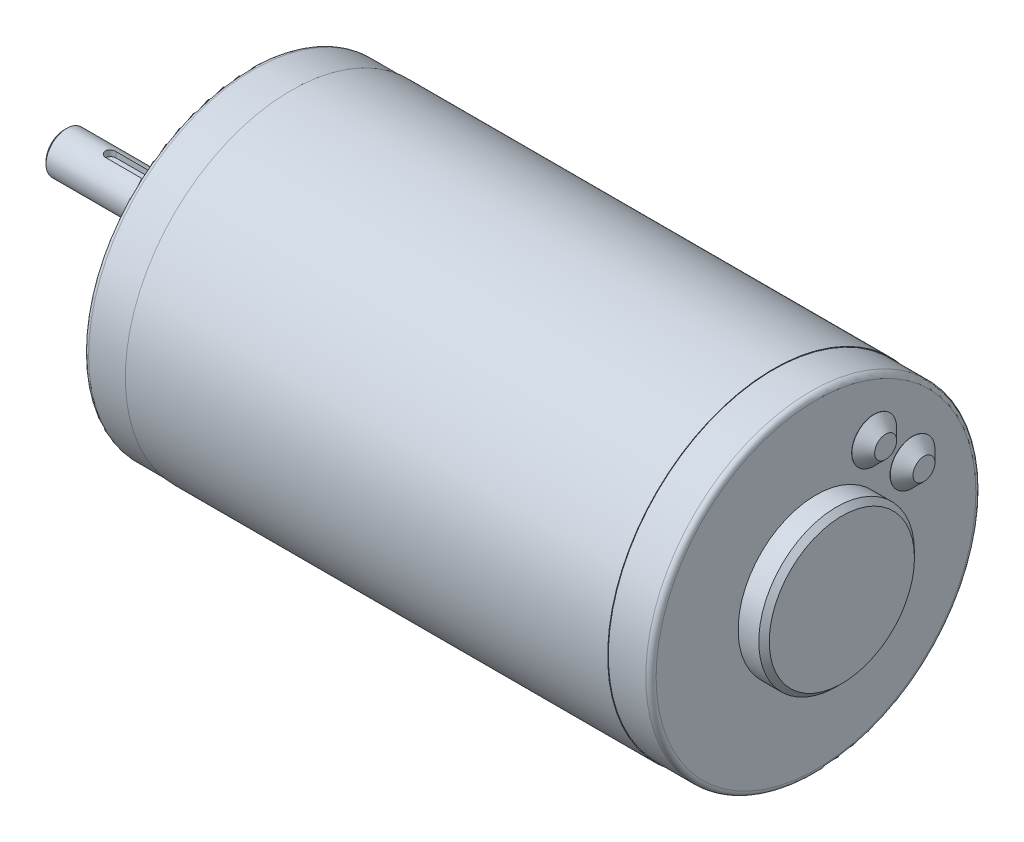
ISO-10303-21;
HEADER;
FILE_DESCRIPTION(('STEP AP214'),'2;1');
FILE_NAME('part.step','',(''),(''),'','','');
FILE_SCHEMA(('AUTOMOTIVE_DESIGN { 1 0 10303 214 1 1 1 1 }'));
ENDSEC;
DATA;
#1=APPLICATION_CONTEXT('core data for automotive mechanical design processes');
#2=APPLICATION_PROTOCOL_DEFINITION('international standard','automotive_design',2000,#1);
#3=PRODUCT_CONTEXT('',#1,'mechanical');
#4=PRODUCT('Part','Part','',(#3));
#5=PRODUCT_RELATED_PRODUCT_CATEGORY('part','',(#4));
#6=PRODUCT_DEFINITION_FORMATION('','',#4);
#7=PRODUCT_DEFINITION_CONTEXT('part definition',#1,'design');
#8=PRODUCT_DEFINITION('design','',#6,#7);
#9=PRODUCT_DEFINITION_SHAPE('','',#8);
#10=(LENGTH_UNIT() NAMED_UNIT(*) SI_UNIT(.MILLI.,.METRE.));
#11=(NAMED_UNIT(*) PLANE_ANGLE_UNIT() SI_UNIT($,.RADIAN.));
#12=(NAMED_UNIT(*) SI_UNIT($,.STERADIAN.) SOLID_ANGLE_UNIT());
#13=UNCERTAINTY_MEASURE_WITH_UNIT(LENGTH_MEASURE(1.E-05),#10,'distance_accuracy_value','');
#14=(GEOMETRIC_REPRESENTATION_CONTEXT(3) GLOBAL_UNCERTAINTY_ASSIGNED_CONTEXT((#13)) GLOBAL_UNIT_ASSIGNED_CONTEXT((#10,
#11,#12)) REPRESENTATION_CONTEXT('',''));
#15=CARTESIAN_POINT('',(0.,0.,0.));
#16=DIRECTION('',(0.,0.,1.));
#17=DIRECTION('',(1.,0.,0.));
#18=AXIS2_PLACEMENT_3D('',#15,#16,#17);
#19=CARTESIAN_POINT('',(8.2296,0.,0.));
#20=DIRECTION('',(1.,0.,0.));
#21=DIRECTION('',(0.,0.,-1.));
#22=AXIS2_PLACEMENT_3D('',#19,#20,#21);
#23=CYLINDRICAL_SURFACE('',#22,32.004);
#24=CARTESIAN_POINT('',(8.2296,0.,0.));
#25=DIRECTION('',(1.,0.,0.));
#26=DIRECTION('',(0.,0.,-1.));
#27=AXIS2_PLACEMENT_3D('',#24,#25,#26);
#28=CIRCLE('',#27,32.004);
#29=CARTESIAN_POINT('',(8.2296,0.,-32.004));
#30=VERTEX_POINT('',#29);
#31=EDGE_CURVE('P0_E184',#30,#30,#28,.T.);
#32=ORIENTED_EDGE('',*,*,#31,.T.);
#33=EDGE_LOOP('',(#32));
#34=FACE_BOUND('',#33,.T.);
#35=CARTESIAN_POINT('',(101.3704,0.,0.));
#36=DIRECTION('',(1.,0.,0.));
#37=DIRECTION('',(0.,0.,-1.));
#38=AXIS2_PLACEMENT_3D('',#35,#36,#37);
#39=CIRCLE('',#38,32.004);
#40=CARTESIAN_POINT('',(101.3704,0.,-32.004));
#41=VERTEX_POINT('',#40);
#42=EDGE_CURVE('P0_E178',#41,#41,#39,.T.);
#43=ORIENTED_EDGE('',*,*,#42,.F.);
#44=EDGE_LOOP('',(#43));
#45=FACE_BOUND('',#44,.T.);
#46=ADVANCED_FACE('P0_F37',(#34,#45),#23,.T.);
#47=CARTESIAN_POINT('',(8.2296,32.004,0.));
#48=DIRECTION('',(-1.,0.,0.));
#49=DIRECTION('',(0.,0.,1.));
#50=AXIS2_PLACEMENT_3D('',#47,#48,#49);
#51=PLANE('',#50);
#52=CARTESIAN_POINT('',(8.2296,0.,0.));
#53=DIRECTION('',(-1.,0.,0.));
#54=DIRECTION('',(0.,0.,1.));
#55=AXIS2_PLACEMENT_3D('',#52,#53,#54);
#56=CIRCLE('',#55,31.877);
#57=CARTESIAN_POINT('',(8.2296,0.,31.877));
#58=VERTEX_POINT('',#57);
#59=EDGE_CURVE('P0_E169',#58,#58,#56,.T.);
#60=ORIENTED_EDGE('',*,*,#59,.F.);
#61=EDGE_LOOP('',(#60));
#62=FACE_BOUND('',#61,.T.);
#63=ORIENTED_EDGE('',*,*,#31,.F.);
#64=EDGE_LOOP('',(#63));
#65=FACE_BOUND('',#64,.T.);
#66=ADVANCED_FACE('P0_F227',(#62,#65),#51,.T.);
#67=CARTESIAN_POINT('',(101.3704,0.,0.));
#68=DIRECTION('',(1.,0.,0.));
#69=DIRECTION('',(0.,0.,-1.));
#70=AXIS2_PLACEMENT_3D('',#67,#68,#69);
#71=PLANE('',#70);
#72=CARTESIAN_POINT('',(101.3704,0.,0.));
#73=DIRECTION('',(1.,0.,0.));
#74=DIRECTION('',(0.,0.,-1.));
#75=AXIS2_PLACEMENT_3D('',#72,#73,#74);
#76=CIRCLE('',#75,31.877);
#77=CARTESIAN_POINT('',(101.3704,0.,-31.877));
#78=VERTEX_POINT('',#77);
#79=EDGE_CURVE('P0_E181',#78,#78,#76,.T.);
#80=ORIENTED_EDGE('',*,*,#79,.F.);
#81=EDGE_LOOP('',(#80));
#82=FACE_BOUND('',#81,.T.);
#83=ORIENTED_EDGE('',*,*,#42,.T.);
#84=EDGE_LOOP('',(#83));
#85=FACE_BOUND('',#84,.T.);
#86=ADVANCED_FACE('P0_F233',(#82,#85),#71,.T.);
#87=CARTESIAN_POINT('',(109.6,0.,0.));
#88=DIRECTION('',(-1.,0.,0.));
#89=DIRECTION('',(0.,0.,1.));
#90=AXIS2_PLACEMENT_3D('',#87,#88,#89);
#91=CYLINDRICAL_SURFACE('',#90,31.877);
#92=CARTESIAN_POINT('',(108.6,0.,0.));
#93=DIRECTION('',(1.,0.,0.));
#94=DIRECTION('',(0.,0.,-1.));
#95=AXIS2_PLACEMENT_3D('',#92,#93,#94);
#96=CIRCLE('',#95,31.877);
#97=CARTESIAN_POINT('',(108.6,0.,-31.877));
#98=VERTEX_POINT('',#97);
#99=EDGE_CURVE('P0_E209',#98,#98,#96,.F.);
#100=ORIENTED_EDGE('',*,*,#99,.T.);
#101=EDGE_LOOP('',(#100));
#102=FACE_BOUND('',#101,.T.);
#103=ORIENTED_EDGE('',*,*,#79,.T.);
#104=EDGE_LOOP('',(#103));
#105=FACE_BOUND('',#104,.T.);
#106=ADVANCED_FACE('P0_F295',(#102,#105),#91,.T.);
#107=CARTESIAN_POINT('',(109.6,0.,0.));
#108=DIRECTION('',(1.,0.,0.));
#109=DIRECTION('',(0.,0.,-1.));
#110=AXIS2_PLACEMENT_3D('',#107,#108,#109);
#111=PLANE('',#110);
#112=CARTESIAN_POINT('',(109.6,0.,0.));
#113=DIRECTION('',(1.,0.,0.));
#114=DIRECTION('',(0.,0.,-1.));
#115=AXIS2_PLACEMENT_3D('',#112,#113,#114);
#116=CIRCLE('',#115,30.877);
#117=CARTESIAN_POINT('',(109.6,0.,-30.877));
#118=VERTEX_POINT('',#117);
#119=EDGE_CURVE('P0_E206',#118,#118,#116,.T.);
#120=ORIENTED_EDGE('',*,*,#119,.T.);
#121=EDGE_LOOP('',(#120));
#122=FACE_BOUND('',#121,.T.);
#123=CARTESIAN_POINT('',(109.6,18.6070906828553,-11.2073596390943));
#124=DIRECTION('',(1.,0.,0.));
#125=DIRECTION('',(0.,0.,-1.));
#126=AXIS2_PLACEMENT_3D('',#123,#124,#125);
#127=CIRCLE('',#126,4.318);
#128=CARTESIAN_POINT('',(109.6,18.6070906828553,-15.5253596390943));
#129=VERTEX_POINT('',#128);
#130=EDGE_CURVE('P0_E191',#129,#129,#127,.T.);
#131=ORIENTED_EDGE('',*,*,#130,.F.);
#132=EDGE_LOOP('',(#131));
#133=FACE_BOUND('',#132,.T.);
#134=CARTESIAN_POINT('',(109.6,11.2073596390943,-18.6070906828553));
#135=DIRECTION('',(1.,0.,0.));
#136=DIRECTION('',(0.,0.,-1.));
#137=AXIS2_PLACEMENT_3D('',#134,#135,#136);
#138=CIRCLE('',#137,4.318);
#139=CARTESIAN_POINT('',(109.6,11.2073596390943,-22.9250906828553));
#140=VERTEX_POINT('',#139);
#141=EDGE_CURVE('P0_E165',#140,#140,#138,.T.);
#142=ORIENTED_EDGE('',*,*,#141,.F.);
#143=EDGE_LOOP('',(#142));
#144=FACE_BOUND('',#143,.T.);
#145=CARTESIAN_POINT('',(109.6,0.,0.));
#146=DIRECTION('',(1.,0.,0.));
#147=DIRECTION('',(0.,0.,-1.));
#148=AXIS2_PLACEMENT_3D('',#145,#146,#147);
#149=CIRCLE('',#148,15.0368);
#150=CARTESIAN_POINT('',(109.6,0.,-15.0368));
#151=VERTEX_POINT('',#150);
#152=EDGE_CURVE('P0_E172',#151,#151,#149,.T.);
#153=ORIENTED_EDGE('',*,*,#152,.F.);
#154=EDGE_LOOP('',(#153));
#155=FACE_BOUND('',#154,.T.);
#156=ADVANCED_FACE('P0_F291',(#122,#133,#144,#155),#111,.T.);
#157=CARTESIAN_POINT('',(113.584,0.,0.));
#158=DIRECTION('',(-1.,0.,0.));
#159=DIRECTION('',(0.,0.,1.));
#160=AXIS2_PLACEMENT_3D('',#157,#158,#159);
#161=CYLINDRICAL_SURFACE('',#160,15.0368);
#162=CARTESIAN_POINT('',(113.584,0.,0.));
#163=DIRECTION('',(1.,0.,0.));
#164=DIRECTION('',(0.,0.,-1.));
#165=AXIS2_PLACEMENT_3D('',#162,#163,#164);
#166=CIRCLE('',#165,15.0368);
#167=CARTESIAN_POINT('',(113.584,0.,-15.0368));
#168=VERTEX_POINT('',#167);
#169=EDGE_CURVE('P0_E175',#168,#168,#166,.T.);
#170=ORIENTED_EDGE('',*,*,#169,.F.);
#171=EDGE_LOOP('',(#170));
#172=FACE_BOUND('',#171,.T.);
#173=ORIENTED_EDGE('',*,*,#152,.T.);
#174=EDGE_LOOP('',(#173));
#175=FACE_BOUND('',#174,.T.);
#176=ADVANCED_FACE('P0_F287',(#172,#175),#161,.T.);
#177=CARTESIAN_POINT('',(113.584,0.,0.));
#178=DIRECTION('',(-1.,0.,0.));
#179=DIRECTION('',(0.,0.,-1.));
#180=AXIS2_PLACEMENT_3D('',#177,#178,#179);
#181=CONICAL_SURFACE('',#180,15.0368,0.785398163397437);
#182=CARTESIAN_POINT('',(114.6,0.,0.));
#183=DIRECTION('',(1.,0.,0.));
#184=DIRECTION('',(0.,0.,-1.));
#185=AXIS2_PLACEMENT_3D('',#182,#183,#184);
#186=CIRCLE('',#185,14.0208);
#187=CARTESIAN_POINT('',(114.6,0.,-14.0208));
#188=VERTEX_POINT('',#187);
#189=EDGE_CURVE('P0_E120',#188,#188,#186,.T.);
#190=ORIENTED_EDGE('',*,*,#189,.F.);
#191=EDGE_LOOP('',(#190));
#192=FACE_BOUND('',#191,.T.);
#193=ORIENTED_EDGE('',*,*,#169,.T.);
#194=EDGE_LOOP('',(#193));
#195=FACE_BOUND('',#194,.T.);
#196=ADVANCED_FACE('P0_F283',(#192,#195),#181,.T.);
#197=CARTESIAN_POINT('',(114.6,0.,0.));
#198=DIRECTION('',(1.,0.,0.));
#199=DIRECTION('',(0.,0.,-1.));
#200=AXIS2_PLACEMENT_3D('',#197,#198,#199);
#201=PLANE('',#200);
#202=ORIENTED_EDGE('',*,*,#189,.T.);
#203=EDGE_LOOP('',(#202));
#204=FACE_BOUND('',#203,.T.);
#205=ADVANCED_FACE('P0_F279',(#204),#201,.T.);
#206=CARTESIAN_POINT('',(0.,0.,0.));
#207=DIRECTION('',(1.,0.,0.));
#208=DIRECTION('',(0.,0.,-1.));
#209=AXIS2_PLACEMENT_3D('',#206,#207,#208);
#210=CYLINDRICAL_SURFACE('',#209,31.877);
#211=CARTESIAN_POINT('',(0.999999999999998,0.,0.));
#212=DIRECTION('',(-1.,0.,0.));
#213=DIRECTION('',(0.,0.,1.));
#214=AXIS2_PLACEMENT_3D('',#211,#212,#213);
#215=CIRCLE('',#214,31.877);
#216=CARTESIAN_POINT('',(0.999999999999998,0.,31.877));
#217=VERTEX_POINT('',#216);
#218=EDGE_CURVE('P0_E11',#217,#217,#215,.F.);
#219=ORIENTED_EDGE('',*,*,#218,.T.);
#220=EDGE_LOOP('',(#219));
#221=FACE_BOUND('',#220,.T.);
#222=ORIENTED_EDGE('',*,*,#59,.T.);
#223=EDGE_LOOP('',(#222));
#224=FACE_BOUND('',#223,.T.);
#225=ADVANCED_FACE('P0_F276',(#221,#224),#210,.T.);
#226=CARTESIAN_POINT('',(0.,0.,0.));
#227=DIRECTION('',(-1.,0.,0.));
#228=DIRECTION('',(0.,0.,1.));
#229=AXIS2_PLACEMENT_3D('',#226,#227,#228);
#230=PLANE('',#229);
#231=CARTESIAN_POINT('',(0.,0.,0.));
#232=DIRECTION('',(-1.,0.,0.));
#233=DIRECTION('',(0.,0.,1.));
#234=AXIS2_PLACEMENT_3D('',#231,#232,#233);
#235=CIRCLE('',#234,30.877);
#236=CARTESIAN_POINT('',(0.,0.,30.877));
#237=VERTEX_POINT('',#236);
#238=EDGE_CURVE('P0_E45',#237,#237,#235,.T.);
#239=ORIENTED_EDGE('',*,*,#238,.T.);
#240=EDGE_LOOP('',(#239));
#241=FACE_BOUND('',#240,.T.);
#242=CARTESIAN_POINT('',(0.,25.4,0.));
#243=DIRECTION('',(-1.,0.,0.));
#244=DIRECTION('',(0.,0.,1.));
#245=AXIS2_PLACEMENT_3D('',#242,#243,#244);
#246=CIRCLE('',#245,2.01929999999999);
#247=CARTESIAN_POINT('',(0.,25.4,2.01929999999999));
#248=VERTEX_POINT('',#247);
#249=EDGE_CURVE('P0_E94',#248,#248,#246,.T.);
#250=ORIENTED_EDGE('',*,*,#249,.F.);
#251=EDGE_LOOP('',(#250));
#252=FACE_BOUND('',#251,.T.);
#253=CARTESIAN_POINT('',(0.,-25.4,0.));
#254=DIRECTION('',(-1.,0.,0.));
#255=DIRECTION('',(0.,0.,1.));
#256=AXIS2_PLACEMENT_3D('',#253,#254,#255);
#257=CIRCLE('',#256,2.01929999999999);
#258=CARTESIAN_POINT('',(0.,-25.4,2.01929999999999));
#259=VERTEX_POINT('',#258);
#260=EDGE_CURVE('P0_E93',#259,#259,#257,.T.);
#261=ORIENTED_EDGE('',*,*,#260,.F.);
#262=EDGE_LOOP('',(#261));
#263=FACE_BOUND('',#262,.T.);
#264=CARTESIAN_POINT('',(0.,0.,0.));
#265=DIRECTION('',(-1.,0.,0.));
#266=DIRECTION('',(0.,0.,1.));
#267=AXIS2_PLACEMENT_3D('',#264,#265,#266);
#268=CIRCLE('',#267,9.525);
#269=CARTESIAN_POINT('',(0.,0.,9.525));
#270=VERTEX_POINT('',#269);
#271=EDGE_CURVE('P0_E166',#270,#270,#268,.T.);
#272=ORIENTED_EDGE('',*,*,#271,.F.);
#273=EDGE_LOOP('',(#272));
#274=FACE_BOUND('',#273,.T.);
#275=ADVANCED_FACE('P0_F214',(#241,#252,#263,#274),#230,.T.);
#276=CARTESIAN_POINT('',(-4.,0.,0.));
#277=DIRECTION('',(1.,0.,0.));
#278=DIRECTION('',(0.,0.,-1.));
#279=AXIS2_PLACEMENT_3D('',#276,#277,#278);
#280=CYLINDRICAL_SURFACE('',#279,9.525);
#281=CARTESIAN_POINT('',(-2.98400000000005,0.,0.));
#282=DIRECTION('',(-1.,0.,0.));
#283=DIRECTION('',(0.,0.,1.));
#284=AXIS2_PLACEMENT_3D('',#281,#282,#283);
#285=CIRCLE('',#284,9.525);
#286=CARTESIAN_POINT('',(-2.98400000000005,0.,9.525));
#287=VERTEX_POINT('',#286);
#288=EDGE_CURVE('P0_E197',#287,#287,#285,.F.);
#289=ORIENTED_EDGE('',*,*,#288,.T.);
#290=EDGE_LOOP('',(#289));
#291=FACE_BOUND('',#290,.T.);
#292=ORIENTED_EDGE('',*,*,#271,.T.);
#293=EDGE_LOOP('',(#292));
#294=FACE_BOUND('',#293,.T.);
#295=ADVANCED_FACE('P0_F269',(#291,#294),#280,.T.);
#296=CARTESIAN_POINT('',(-4.,0.,0.));
#297=DIRECTION('',(-1.,0.,0.));
#298=DIRECTION('',(0.,0.,1.));
#299=AXIS2_PLACEMENT_3D('',#296,#297,#298);
#300=PLANE('',#299);
#301=CARTESIAN_POINT('',(-4.,0.,0.));
#302=DIRECTION('',(-1.,0.,0.));
#303=DIRECTION('',(0.,0.,1.));
#304=AXIS2_PLACEMENT_3D('',#301,#302,#303);
#305=CIRCLE('',#304,8.50900000000004);
#306=CARTESIAN_POINT('',(-4.,0.,8.50900000000004));
#307=VERTEX_POINT('',#306);
#308=EDGE_CURVE('P0_E194',#307,#307,#305,.T.);
#309=ORIENTED_EDGE('',*,*,#308,.T.);
#310=EDGE_LOOP('',(#309));
#311=FACE_BOUND('',#310,.T.);
#312=CARTESIAN_POINT('',(-4.,0.,0.));
#313=DIRECTION('',(-1.,0.,0.));
#314=DIRECTION('',(0.,0.,1.));
#315=AXIS2_PLACEMENT_3D('',#312,#313,#314);
#316=CIRCLE('',#315,4.);
#317=CARTESIAN_POINT('',(-4.,0.,4.));
#318=VERTEX_POINT('',#317);
#319=EDGE_CURVE('P0_E162',#318,#318,#316,.T.);
#320=ORIENTED_EDGE('',*,*,#319,.F.);
#321=EDGE_LOOP('',(#320));
#322=FACE_BOUND('',#321,.T.);
#323=ADVANCED_FACE('P0_F262',(#311,#322),#300,.T.);
#324=CARTESIAN_POINT('',(-35.6,0.,0.));
#325=DIRECTION('',(1.,0.,0.));
#326=DIRECTION('',(0.,0.,-1.));
#327=AXIS2_PLACEMENT_3D('',#324,#325,#326);
#328=CYLINDRICAL_SURFACE('',#327,4.);
#329=CARTESIAN_POINT('',(-35.099999999993,0.,0.));
#330=DIRECTION('',(-1.,0.,0.));
#331=DIRECTION('',(0.,0.,1.));
#332=AXIS2_PLACEMENT_3D('',#329,#330,#331);
#333=CIRCLE('',#332,4.);
#334=CARTESIAN_POINT('',(-35.099999999993,0.,4.));
#335=VERTEX_POINT('',#334);
#336=EDGE_CURVE('P0_E203',#335,#335,#333,.F.);
#337=ORIENTED_EDGE('',*,*,#336,.T.);
#338=EDGE_LOOP('',(#337));
#339=FACE_BOUND('',#338,.T.);
#340=DIRECTION('',(1.,0.,0.));
#341=VECTOR('',#340,1.);
#342=CARTESIAN_POINT('',(0.,3.87298334620741,-1.));
#343=LINE('',#342,#341);
#344=CARTESIAN_POINT('',(-26.6,3.87298334620741,-1.));
#345=VERTEX_POINT('',#344);
#346=CARTESIAN_POINT('',(-7.1,3.87298334620741,-1.));
#347=VERTEX_POINT('',#346);
#348=EDGE_CURVE('P0_E139',#345,#347,#343,.T.);
#349=ORIENTED_EDGE('',*,*,#348,.T.);
#350=CARTESIAN_POINT('',(-7.1,3.87298334620741,-1.));
#351=CARTESIAN_POINT('',(-7.07233701489346,3.87298148580177,-1.00000033749611));
#352=CARTESIAN_POINT('',(-7.04468773698177,3.8732800994947,-0.998851407375366));
#353=CARTESIAN_POINT('',(-6.98959596469644,3.87445904774558,-0.994271295395754));
#354=CARTESIAN_POINT('',(-6.96215343631291,3.87533928441687,-0.990840497572679));
#355=CARTESIAN_POINT('',(-6.88054682679116,3.87881710972053,-0.977175239382526));
#356=CARTESIAN_POINT('',(-6.82694353151779,3.88225203148808,-0.963567695172493));
#357=CARTESIAN_POINT('',(-6.72287532621804,3.89095422588002,-0.927798076247997));
#358=CARTESIAN_POINT('',(-6.67241012178714,3.89622132630929,-0.905636805423836));
#359=CARTESIAN_POINT('',(-6.57588855135267,3.90799134471939,-0.853415378025865));
#360=CARTESIAN_POINT('',(-6.52983337210904,3.91449459395647,-0.823353103356933));
#361=CARTESIAN_POINT('',(-6.4424561180939,3.92816262398025,-0.755484471828069));
#362=CARTESIAN_POINT('',(-6.40124511375448,3.93533791028915,-0.717537268783976));
#363=CARTESIAN_POINT('',(-6.32569791051729,3.94945104396193,-0.63527578051623));
#364=CARTESIAN_POINT('',(-6.29136281053206,3.95638885322537,-0.590960479478831));
#365=CARTESIAN_POINT('',(-6.23008899838136,3.96936182283248,-0.496456899401691));
#366=CARTESIAN_POINT('',(-6.20326010401603,3.9753830468173,-0.446195340334474));
#367=CARTESIAN_POINT('',(-6.1584752658033,3.98572346250588,-0.341702590842919));
#368=CARTESIAN_POINT('',(-6.14051757570017,3.990042989147,-0.28747218408301));
#369=CARTESIAN_POINT('',(-6.11434100722257,3.99641900005128,-0.17774410852516));
#370=CARTESIAN_POINT('',(-6.10593232757718,3.998519529013,-0.122294322002858));
#371=CARTESIAN_POINT('',(-6.09849662845671,4.00037438150815,-0.0107327756816796));
#372=CARTESIAN_POINT('',(-6.09946842980766,4.00012899993444,0.0453789000287057));
#373=CARTESIAN_POINT('',(-6.11062996368545,3.99735237365735,0.155352492972096));
#374=CARTESIAN_POINT('',(-6.12061461659948,3.9948719867736,0.209236701739855));
#375=CARTESIAN_POINT('',(-6.14918867918275,3.98796330636495,0.31453871108434));
#376=CARTESIAN_POINT('',(-6.16777846956858,3.98353492665556,0.365956402423988));
#377=CARTESIAN_POINT('',(-6.21320128067065,3.97314997761798,0.465407286024539));
#378=CARTESIAN_POINT('',(-6.24010739423284,3.96717993827555,0.513405629602248));
#379=CARTESIAN_POINT('',(-6.30134312983347,3.95435945541919,0.604276631230014));
#380=CARTESIAN_POINT('',(-6.33567387025322,3.94750887933198,0.647148515562289));
#381=CARTESIAN_POINT('',(-6.41187891208131,3.93345566022865,0.72776938970849));
#382=CARTESIAN_POINT('',(-6.45393163653981,3.92624850477685,0.765349103054127));
#383=CARTESIAN_POINT('',(-6.54382986692773,3.91246168284006,0.832969575186237));
#384=CARTESIAN_POINT('',(-6.59167695328356,3.90588218842993,0.863008270245062));
#385=CARTESIAN_POINT('',(-6.69214559782377,3.89407813586325,0.914804709285962));
#386=CARTESIAN_POINT('',(-6.74479146489609,3.88886106009136,0.936517017887269));
#387=CARTESIAN_POINT('',(-6.85311692841829,3.88047058807055,0.970702351849829));
#388=CARTESIAN_POINT('',(-6.90879185514984,3.87729413761435,0.983189189212132));
#389=CARTESIAN_POINT('',(-6.9874573807589,3.87455290681524,0.993904635150938));
#390=CARTESIAN_POINT('',(-7.00991970321318,3.87396523110859,0.996190790966708));
#391=CARTESIAN_POINT('',(-7.05491778990932,3.87318062488974,0.999236757697394));
#392=CARTESIAN_POINT('',(-7.07745337595529,3.87298306219461,0.999999038096045));
#393=CARTESIAN_POINT('',(-7.1,3.87298334620741,1.));
#394=B_SPLINE_CURVE_WITH_KNOTS('',3,(#350,#351,#352,#353,#354,#355,#356,#357,#358,#359,#360,
#361,#362,#363,#364,#365,#366,#367,#368,#369,#370,#371,#372,#373,#374,#375,#376,#377,#378,#379,
#380,#381,#382,#383,#384,#385,#386,#387,#388,#389,#390,#391,#392,#393),.UNSPECIFIED.,.F.,.F.,(4,
2,2,2,2,2,2,2,2,2,2,2,2,2,2,2,2,2,2,2,2,4),(0.,0.0829365303397693,0.165859106084651,
0.331229963080317,0.496585282091498,0.661984974726749,0.830641897427974,0.999325753539193,
1.17036187098235,1.34136430732424,1.50890481515325,1.67642426256639,1.84022545479276,
2.00403389475838,2.16932509450376,2.33464120964329,2.50441429534542,2.67423379180967,
2.84496720161068,3.01544447539986,3.08315848722648,3.15076267731671),.UNSPECIFIED.);
#395=CARTESIAN_POINT('',(-7.1,3.87298334620741,1.));
#396=VERTEX_POINT('',#395);
#397=EDGE_CURVE('P0_E116',#347,#396,#394,.T.);
#398=ORIENTED_EDGE('',*,*,#397,.T.);
#399=DIRECTION('',(1.,0.,0.));
#400=VECTOR('',#399,1.);
#401=CARTESIAN_POINT('',(0.,3.87298334620741,1.));
#402=LINE('',#401,#400);
#403=CARTESIAN_POINT('',(-26.6,3.87298334620741,1.));
#404=VERTEX_POINT('',#403);
#405=EDGE_CURVE('P0_E154',#396,#404,#402,.F.);
#406=ORIENTED_EDGE('',*,*,#405,.T.);
#407=CARTESIAN_POINT('',(-26.6,3.87298334620741,1.));
#408=CARTESIAN_POINT('',(-26.6276629851065,3.87298148580177,1.00000033749611));
#409=CARTESIAN_POINT('',(-26.6553122630182,3.8732800994947,0.998851407375366));
#410=CARTESIAN_POINT('',(-26.7104040353036,3.87445904774558,0.994271295395754));
#411=CARTESIAN_POINT('',(-26.7378465636871,3.87533928441687,0.990840497572679));
#412=CARTESIAN_POINT('',(-26.8194531732088,3.87881710972053,0.977175239382526));
#413=CARTESIAN_POINT('',(-26.8730564684822,3.88225203148808,0.963567695172493));
#414=CARTESIAN_POINT('',(-26.977124673782,3.89095422588002,0.927798076247996));
#415=CARTESIAN_POINT('',(-27.0275898782129,3.89622132630929,0.905636805423835));
#416=CARTESIAN_POINT('',(-27.1241114486473,3.90799134471939,0.853415378025864));
#417=CARTESIAN_POINT('',(-27.170166627891,3.91449459395647,0.823353103356932));
#418=CARTESIAN_POINT('',(-27.2575438819061,3.92816262398025,0.755484471828069));
#419=CARTESIAN_POINT('',(-27.2987548862455,3.93533791028915,0.717537268783975));
#420=CARTESIAN_POINT('',(-27.3743020894827,3.94945104396193,0.635275780516229));
#421=CARTESIAN_POINT('',(-27.4086371894679,3.95638885322537,0.59096047947883));
#422=CARTESIAN_POINT('',(-27.4699110016186,3.96936182283248,0.496456899401689));
#423=CARTESIAN_POINT('',(-27.496739895984,3.9753830468173,0.446195340334472));
#424=CARTESIAN_POINT('',(-27.5415247341967,3.98572346250588,0.341702590842916));
#425=CARTESIAN_POINT('',(-27.5594824242998,3.990042989147,0.287472184083007));
#426=CARTESIAN_POINT('',(-27.5856589927774,3.99641900005128,0.177744108525158));
#427=CARTESIAN_POINT('',(-27.5940676724228,3.998519529013,0.122294322002856));
#428=CARTESIAN_POINT('',(-27.6015033715433,4.00037438150815,0.0107327756816781));
#429=CARTESIAN_POINT('',(-27.6005315701923,4.00012899993444,-0.0453789000287067));
#430=CARTESIAN_POINT('',(-27.5893700363146,3.99735237365735,-0.155352492972096));
#431=CARTESIAN_POINT('',(-27.5793853834005,3.9948719867736,-0.209236701739855));
#432=CARTESIAN_POINT('',(-27.5508113208173,3.98796330636495,-0.31453871108434));
#433=CARTESIAN_POINT('',(-27.5322215304314,3.98353492665556,-0.365956402423988));
#434=CARTESIAN_POINT('',(-27.4867987193294,3.97314997761798,-0.46540728602454));
#435=CARTESIAN_POINT('',(-27.4598926057672,3.96717993827555,-0.513405629602248));
#436=CARTESIAN_POINT('',(-27.3986568701665,3.95435945541919,-0.604276631230015));
#437=CARTESIAN_POINT('',(-27.3643261297468,3.94750887933198,-0.64714851556229));
#438=CARTESIAN_POINT('',(-27.2881210879187,3.93345566022865,-0.727769389708492));
#439=CARTESIAN_POINT('',(-27.2460683634602,3.92624850477685,-0.765349103054128));
#440=CARTESIAN_POINT('',(-27.1561701330723,3.91246168284006,-0.832969575186237));
#441=CARTESIAN_POINT('',(-27.1083230467164,3.90588218842993,-0.863008270245062));
#442=CARTESIAN_POINT('',(-27.0078544021762,3.89407813586325,-0.914804709285961));
#443=CARTESIAN_POINT('',(-26.9552085351039,3.88886106009136,-0.936517017887269));
#444=CARTESIAN_POINT('',(-26.8468830715817,3.88047058807054,-0.970702351849828));
#445=CARTESIAN_POINT('',(-26.7912081448502,3.87729413761435,-0.983189189212131));
#446=CARTESIAN_POINT('',(-26.7125426192411,3.87455290681524,-0.993904635150938));
#447=CARTESIAN_POINT('',(-26.6900802967868,3.87396523110859,-0.996190790966708));
#448=CARTESIAN_POINT('',(-26.6450822100907,3.87318062488974,-0.999236757697394));
#449=CARTESIAN_POINT('',(-26.6225466240447,3.87298306219461,-0.999999038096045));
#450=CARTESIAN_POINT('',(-26.6,3.87298334620741,-1.));
#451=B_SPLINE_CURVE_WITH_KNOTS('',3,(#407,#408,#409,#410,#411,#412,#413,#414,#415,#416,#417,
#418,#419,#420,#421,#422,#423,#424,#425,#426,#427,#428,#429,#430,#431,#432,#433,#434,#435,#436,
#437,#438,#439,#440,#441,#442,#443,#444,#445,#446,#447,#448,#449,#450),.UNSPECIFIED.,.F.,.F.,(4,
2,2,2,2,2,2,2,2,2,2,2,2,2,2,2,2,2,2,2,2,4),(0.,0.0829365303397727,0.165859106084653,
0.331229963080318,0.496585282091499,0.661984974726751,0.830641897427976,0.999325753539196,
1.17036187098235,1.34136430732425,1.50890481515325,1.67642426256639,1.84022545479276,
2.00403389475838,2.16932509450376,2.33464120964329,2.50441429534542,2.67423379180967,
2.84496720161068,3.01544447539986,3.08315848722649,3.15076267731671),.UNSPECIFIED.);
#452=EDGE_CURVE('P0_E52',#404,#345,#451,.T.);
#453=ORIENTED_EDGE('',*,*,#452,.T.);
#454=EDGE_LOOP('',(#349,#398,#406,#453));
#455=FACE_BOUND('',#454,.T.);
#456=ORIENTED_EDGE('',*,*,#319,.T.);
#457=EDGE_LOOP('',(#456));
#458=FACE_BOUND('',#457,.T.);
#459=ADVANCED_FACE('P0_F254',(#339,#455,#458),#328,.T.);
#460=CARTESIAN_POINT('',(-35.6,0.,0.));
#461=DIRECTION('',(-1.,0.,0.));
#462=DIRECTION('',(0.,0.,1.));
#463=AXIS2_PLACEMENT_3D('',#460,#461,#462);
#464=PLANE('',#463);
#465=CARTESIAN_POINT('',(-35.6,0.,0.));
#466=DIRECTION('',(-1.,0.,0.));
#467=DIRECTION('',(0.,0.,1.));
#468=AXIS2_PLACEMENT_3D('',#465,#466,#467);
#469=CIRCLE('',#468,3.49999999993619);
#470=CARTESIAN_POINT('',(-35.6,0.,3.49999999993619));
#471=VERTEX_POINT('',#470);
#472=EDGE_CURVE('P0_E200',#471,#471,#469,.T.);
#473=ORIENTED_EDGE('',*,*,#472,.T.);
#474=EDGE_LOOP('',(#473));
#475=FACE_BOUND('',#474,.T.);
#476=ADVANCED_FACE('P0_F251',(#475),#464,.T.);
#477=CARTESIAN_POINT('',(-7.1,32.005,0.));
#478=DIRECTION('',(0.,-1.,0.));
#479=DIRECTION('',(0.,0.,-1.));
#480=AXIS2_PLACEMENT_3D('',#477,#478,#479);
#481=CYLINDRICAL_SURFACE('',#480,1.);
#482=ORIENTED_EDGE('',*,*,#397,.F.);
#483=DIRECTION('',(0.,-1.,0.));
#484=VECTOR('',#483,1.);
#485=CARTESIAN_POINT('',(-7.1,32.005,-1.));
#486=LINE('',#485,#484);
#487=CARTESIAN_POINT('',(-7.1,2.79999999999999,-1.));
#488=VERTEX_POINT('',#487);
#489=EDGE_CURVE('P0_E138',#347,#488,#486,.T.);
#490=ORIENTED_EDGE('',*,*,#489,.T.);
#491=CARTESIAN_POINT('',(-7.1,2.79999999999999,0.));
#492=DIRECTION('',(0.,-1.,0.));
#493=DIRECTION('',(0.,0.,-1.));
#494=AXIS2_PLACEMENT_3D('',#491,#492,#493);
#495=CIRCLE('',#494,1.);
#496=CARTESIAN_POINT('',(-7.1,2.79999999999999,1.));
#497=VERTEX_POINT('',#496);
#498=EDGE_CURVE('P0_E127',#488,#497,#495,.T.);
#499=ORIENTED_EDGE('',*,*,#498,.T.);
#500=DIRECTION('',(0.,-1.,0.));
#501=VECTOR('',#500,1.);
#502=CARTESIAN_POINT('',(-7.1,32.005,1.));
#503=LINE('',#502,#501);
#504=EDGE_CURVE('P0_E60',#396,#497,#503,.T.);
#505=ORIENTED_EDGE('',*,*,#504,.F.);
#506=EDGE_LOOP('',(#482,#490,#499,#505));
#507=FACE_BOUND('',#506,.T.);
#508=ADVANCED_FACE('P0_F253',(#507),#481,.F.);
#509=CARTESIAN_POINT('',(-26.6,32.005,-1.));
#510=DIRECTION('',(0.,0.,-1.));
#511=DIRECTION('',(-1.,0.,0.));
#512=AXIS2_PLACEMENT_3D('',#509,#510,#511);
#513=PLANE('',#512);
#514=ORIENTED_EDGE('',*,*,#348,.F.);
#515=DIRECTION('',(0.,-1.,0.));
#516=VECTOR('',#515,1.);
#517=CARTESIAN_POINT('',(-26.6,32.005,-1.));
#518=LINE('',#517,#516);
#519=CARTESIAN_POINT('',(-26.6,2.79999999999999,-1.));
#520=VERTEX_POINT('',#519);
#521=EDGE_CURVE('P0_E137',#345,#520,#518,.T.);
#522=ORIENTED_EDGE('',*,*,#521,.T.);
#523=DIRECTION('',(1.,0.,0.));
#524=VECTOR('',#523,1.);
#525=CARTESIAN_POINT('',(-26.6,2.79999999999999,-1.));
#526=LINE('',#525,#524);
#527=EDGE_CURVE('P0_E117',#520,#488,#526,.T.);
#528=ORIENTED_EDGE('',*,*,#527,.T.);
#529=ORIENTED_EDGE('',*,*,#489,.F.);
#530=EDGE_LOOP('',(#514,#522,#528,#529));
#531=FACE_BOUND('',#530,.T.);
#532=ADVANCED_FACE('P0_F260',(#531),#513,.F.);
#533=CARTESIAN_POINT('',(-26.6,32.005,0.));
#534=DIRECTION('',(0.,-1.,0.));
#535=DIRECTION('',(0.,0.,-1.));
#536=AXIS2_PLACEMENT_3D('',#533,#534,#535);
#537=CYLINDRICAL_SURFACE('',#536,1.);
#538=ORIENTED_EDGE('',*,*,#452,.F.);
#539=DIRECTION('',(0.,-1.,0.));
#540=VECTOR('',#539,1.);
#541=CARTESIAN_POINT('',(-26.6,32.005,1.));
#542=LINE('',#541,#540);
#543=CARTESIAN_POINT('',(-26.6,2.79999999999999,1.));
#544=VERTEX_POINT('',#543);
#545=EDGE_CURVE('P0_E129',#404,#544,#542,.T.);
#546=ORIENTED_EDGE('',*,*,#545,.T.);
#547=CARTESIAN_POINT('',(-26.6,2.79999999999999,0.));
#548=DIRECTION('',(0.,-1.,0.));
#549=DIRECTION('',(0.,0.,-1.));
#550=AXIS2_PLACEMENT_3D('',#547,#548,#549);
#551=CIRCLE('',#550,1.);
#552=EDGE_CURVE('P0_E121',#544,#520,#551,.T.);
#553=ORIENTED_EDGE('',*,*,#552,.T.);
#554=ORIENTED_EDGE('',*,*,#521,.F.);
#555=EDGE_LOOP('',(#538,#546,#553,#554));
#556=FACE_BOUND('',#555,.T.);
#557=ADVANCED_FACE('P0_F475',(#556),#537,.F.);
#558=CARTESIAN_POINT('',(-7.1,32.005,1.));
#559=DIRECTION('',(0.,0.,1.));
#560=DIRECTION('',(1.,0.,0.));
#561=AXIS2_PLACEMENT_3D('',#558,#559,#560);
#562=PLANE('',#561);
#563=ORIENTED_EDGE('',*,*,#405,.F.);
#564=ORIENTED_EDGE('',*,*,#504,.T.);
#565=DIRECTION('',(-1.,0.,0.));
#566=VECTOR('',#565,1.);
#567=CARTESIAN_POINT('',(-7.1,2.79999999999999,1.));
#568=LINE('',#567,#566);
#569=EDGE_CURVE('P0_E124',#497,#544,#568,.T.);
#570=ORIENTED_EDGE('',*,*,#569,.T.);
#571=ORIENTED_EDGE('',*,*,#545,.F.);
#572=EDGE_LOOP('',(#563,#564,#570,#571));
#573=FACE_BOUND('',#572,.T.);
#574=ADVANCED_FACE('P0_F467',(#573),#562,.F.);
#575=CARTESIAN_POINT('',(-7.1,2.79999999999999,0.));
#576=DIRECTION('',(0.,-1.,0.));
#577=DIRECTION('',(0.,0.,-1.));
#578=AXIS2_PLACEMENT_3D('',#575,#576,#577);
#579=PLANE('',#578);
#580=ORIENTED_EDGE('',*,*,#498,.F.);
#581=ORIENTED_EDGE('',*,*,#527,.F.);
#582=ORIENTED_EDGE('',*,*,#552,.F.);
#583=ORIENTED_EDGE('',*,*,#569,.F.);
#584=EDGE_LOOP('',(#580,#581,#582,#583));
#585=FACE_BOUND('',#584,.T.);
#586=ADVANCED_FACE('P0_F458',(#585),#579,.F.);
#587=CARTESIAN_POINT('',(109.6,11.2073596390943,-18.6070906828553));
#588=DIRECTION('',(1.,0.,0.));
#589=DIRECTION('',(0.,0.,-1.));
#590=AXIS2_PLACEMENT_3D('',#587,#588,#589);
#591=CYLINDRICAL_SURFACE('',#590,4.318);
#592=ORIENTED_EDGE('',*,*,#141,.T.);
#593=EDGE_LOOP('',(#592));
#594=FACE_BOUND('',#593,.T.);
#595=CARTESIAN_POINT('',(109.6479,11.2073596390943,-18.6070906828553));
#596=DIRECTION('',(1.,0.,0.));
#597=DIRECTION('',(0.,0.,-1.));
#598=AXIS2_PLACEMENT_3D('',#595,#596,#597);
#599=CIRCLE('',#598,4.318);
#600=CARTESIAN_POINT('',(109.6479,11.2073596390943,-22.9250906828553));
#601=VERTEX_POINT('',#600);
#602=EDGE_CURVE('P0_E110',#601,#601,#599,.T.);
#603=ORIENTED_EDGE('',*,*,#602,.F.);
#604=EDGE_LOOP('',(#603));
#605=FACE_BOUND('',#604,.T.);
#606=ADVANCED_FACE('P0_F449',(#594,#605),#591,.T.);
#607=CARTESIAN_POINT('',(111.847899999964,11.2073596390943,-18.6070906828553));
#608=DIRECTION('',(1.,0.,0.));
#609=DIRECTION('',(0.,0.,-1.));
#610=AXIS2_PLACEMENT_3D('',#607,#608,#609);
#611=PLANE('',#610);
#612=CARTESIAN_POINT('',(111.847899999964,11.2073596390943,-18.6070906828553));
#613=DIRECTION('',(1.,0.,0.));
#614=DIRECTION('',(0.,0.,-1.));
#615=AXIS2_PLACEMENT_3D('',#612,#613,#614);
#616=CIRCLE('',#615,2.11800000003618);
#617=CARTESIAN_POINT('',(111.847899999964,11.2073596390943,-20.7250906828915));
#618=VERTEX_POINT('',#617);
#619=EDGE_CURVE('P0_E113',#618,#618,#616,.T.);
#620=ORIENTED_EDGE('',*,*,#619,.T.);
#621=EDGE_LOOP('',(#620));
#622=FACE_BOUND('',#621,.T.);
#623=ADVANCED_FACE('P0_F440',(#622),#611,.T.);
#624=CARTESIAN_POINT('',(111.847899999964,11.2073596390943,-18.6070906828553));
#625=DIRECTION('',(-1.,0.,0.));
#626=DIRECTION('',(0.,0.,1.));
#627=AXIS2_PLACEMENT_3D('',#624,#625,#626);
#628=CONICAL_SURFACE('',#627,2.11800000003618,0.78539816339745);
#629=ORIENTED_EDGE('',*,*,#602,.T.);
#630=EDGE_LOOP('',(#629));
#631=FACE_BOUND('',#630,.T.);
#632=ORIENTED_EDGE('',*,*,#619,.F.);
#633=EDGE_LOOP('',(#632));
#634=FACE_BOUND('',#633,.T.);
#635=ADVANCED_FACE('P0_F431',(#631,#634),#628,.T.);
#636=CARTESIAN_POINT('',(109.6,18.6070906828553,-11.2073596390943));
#637=DIRECTION('',(1.,0.,0.));
#638=DIRECTION('',(0.,0.,-1.));
#639=AXIS2_PLACEMENT_3D('',#636,#637,#638);
#640=CYLINDRICAL_SURFACE('',#639,4.318);
#641=ORIENTED_EDGE('',*,*,#130,.T.);
#642=EDGE_LOOP('',(#641));
#643=FACE_BOUND('',#642,.T.);
#644=CARTESIAN_POINT('',(109.6479,18.6070906828553,-11.2073596390943));
#645=DIRECTION('',(1.,0.,0.));
#646=DIRECTION('',(0.,0.,-1.));
#647=AXIS2_PLACEMENT_3D('',#644,#645,#646);
#648=CIRCLE('',#647,4.318);
#649=CARTESIAN_POINT('',(109.6479,18.6070906828553,-15.5253596390943));
#650=VERTEX_POINT('',#649);
#651=EDGE_CURVE('P0_E104',#650,#650,#648,.T.);
#652=ORIENTED_EDGE('',*,*,#651,.F.);
#653=EDGE_LOOP('',(#652));
#654=FACE_BOUND('',#653,.T.);
#655=ADVANCED_FACE('P0_F422',(#643,#654),#640,.T.);
#656=CARTESIAN_POINT('',(111.847899999949,18.6070906828553,-11.2073596390943));
#657=DIRECTION('',(1.,0.,0.));
#658=DIRECTION('',(0.,0.,-1.));
#659=AXIS2_PLACEMENT_3D('',#656,#657,#658);
#660=PLANE('',#659);
#661=CARTESIAN_POINT('',(111.847899999949,18.6070906828553,-11.2073596390943));
#662=DIRECTION('',(1.,0.,0.));
#663=DIRECTION('',(0.,0.,-1.));
#664=AXIS2_PLACEMENT_3D('',#661,#662,#663);
#665=CIRCLE('',#664,2.11800000005086);
#666=CARTESIAN_POINT('',(111.847899999949,18.6070906828553,-13.3253596391452));
#667=VERTEX_POINT('',#666);
#668=EDGE_CURVE('P0_E107',#667,#667,#665,.T.);
#669=ORIENTED_EDGE('',*,*,#668,.T.);
#670=EDGE_LOOP('',(#669));
#671=FACE_BOUND('',#670,.T.);
#672=ADVANCED_FACE('P0_F413',(#671),#660,.T.);
#673=CARTESIAN_POINT('',(111.847899999949,18.6070906828553,-11.2073596390943));
#674=DIRECTION('',(-1.,0.,0.));
#675=DIRECTION('',(0.,0.,1.));
#676=AXIS2_PLACEMENT_3D('',#673,#674,#675);
#677=CONICAL_SURFACE('',#676,2.11800000005086,0.785398163397448);
#678=ORIENTED_EDGE('',*,*,#651,.T.);
#679=EDGE_LOOP('',(#678));
#680=FACE_BOUND('',#679,.T.);
#681=ORIENTED_EDGE('',*,*,#668,.F.);
#682=EDGE_LOOP('',(#681));
#683=FACE_BOUND('',#682,.T.);
#684=ADVANCED_FACE('P0_F404',(#680,#683),#677,.T.);
#685=CARTESIAN_POINT('',(13.6144,-25.4,0.));
#686=DIRECTION('',(-1.,0.,0.));
#687=DIRECTION('',(0.,0.,1.));
#688=AXIS2_PLACEMENT_3D('',#685,#686,#687);
#689=CONICAL_SURFACE('',#688,2.01929999999999,1.02974425867198);
#690=CARTESIAN_POINT('',(14.8277178480152,-25.4,0.));
#691=VERTEX_POINT('',#690);
#692=VERTEX_LOOP('',#691);
#693=FACE_BOUND('',#692,.T.);
#694=CARTESIAN_POINT('',(13.6144,-25.4,0.));
#695=DIRECTION('',(-1.,0.,0.));
#696=DIRECTION('',(0.,0.,1.));
#697=AXIS2_PLACEMENT_3D('',#694,#695,#696);
#698=CIRCLE('',#697,2.01929999999999);
#699=CARTESIAN_POINT('',(13.6144,-25.4,2.01929999999999));
#700=VERTEX_POINT('',#699);
#701=EDGE_CURVE('P0_E97',#700,#700,#698,.T.);
#702=ORIENTED_EDGE('',*,*,#701,.T.);
#703=EDGE_LOOP('',(#702));
#704=FACE_BOUND('',#703,.T.);
#705=ADVANCED_FACE('P0_F395',(#693,#704),#689,.F.);
#706=CARTESIAN_POINT('',(0.,-25.4,0.));
#707=DIRECTION('',(-1.,0.,0.));
#708=DIRECTION('',(0.,0.,1.));
#709=AXIS2_PLACEMENT_3D('',#706,#707,#708);
#710=CYLINDRICAL_SURFACE('',#709,2.01929999999999);
#711=ORIENTED_EDGE('',*,*,#701,.F.);
#712=EDGE_LOOP('',(#711));
#713=FACE_BOUND('',#712,.T.);
#714=ORIENTED_EDGE('',*,*,#260,.T.);
#715=EDGE_LOOP('',(#714));
#716=FACE_BOUND('',#715,.T.);
#717=ADVANCED_FACE('P0_F87',(#713,#716),#710,.F.);
#718=CARTESIAN_POINT('',(13.6144,25.4,0.));
#719=DIRECTION('',(-1.,0.,0.));
#720=DIRECTION('',(0.,0.,1.));
#721=AXIS2_PLACEMENT_3D('',#718,#719,#720);
#722=CONICAL_SURFACE('',#721,2.01929999999999,1.02974425867198);
#723=CARTESIAN_POINT('',(14.8277178480152,25.4,0.));
#724=VERTEX_POINT('',#723);
#725=VERTEX_LOOP('',#724);
#726=FACE_BOUND('',#725,.T.);
#727=CARTESIAN_POINT('',(13.6144,25.4,0.));
#728=DIRECTION('',(-1.,0.,0.));
#729=DIRECTION('',(0.,0.,1.));
#730=AXIS2_PLACEMENT_3D('',#727,#728,#729);
#731=CIRCLE('',#730,2.01929999999999);
#732=CARTESIAN_POINT('',(13.6144,25.4,2.01929999999999));
#733=VERTEX_POINT('',#732);
#734=EDGE_CURVE('P0_E91',#733,#733,#731,.T.);
#735=ORIENTED_EDGE('',*,*,#734,.T.);
#736=EDGE_LOOP('',(#735));
#737=FACE_BOUND('',#736,.T.);
#738=ADVANCED_FACE('P0_F83',(#726,#737),#722,.F.);
#739=CARTESIAN_POINT('',(0.,25.4,0.));
#740=DIRECTION('',(-1.,0.,0.));
#741=DIRECTION('',(0.,0.,1.));
#742=AXIS2_PLACEMENT_3D('',#739,#740,#741);
#743=CYLINDRICAL_SURFACE('',#742,2.01929999999999);
#744=ORIENTED_EDGE('',*,*,#734,.F.);
#745=EDGE_LOOP('',(#744));
#746=FACE_BOUND('',#745,.T.);
#747=ORIENTED_EDGE('',*,*,#249,.T.);
#748=EDGE_LOOP('',(#747));
#749=FACE_BOUND('',#748,.T.);
#750=ADVANCED_FACE('P0_F86',(#746,#749),#743,.F.);
#751=CARTESIAN_POINT('',(-4.,0.,0.));
#752=DIRECTION('',(1.,0.,0.));
#753=DIRECTION('',(0.,0.,-1.));
#754=AXIS2_PLACEMENT_3D('',#751,#752,#753);
#755=CONICAL_SURFACE('',#754,8.50900000000004,0.785398163397452);
#756=ORIENTED_EDGE('',*,*,#288,.F.);
#757=EDGE_LOOP('',(#756));
#758=FACE_BOUND('',#757,.T.);
#759=ORIENTED_EDGE('',*,*,#308,.F.);
#760=EDGE_LOOP('',(#759));
#761=FACE_BOUND('',#760,.T.);
#762=ADVANCED_FACE('P0_F239',(#758,#761),#755,.T.);
#763=CARTESIAN_POINT('',(-35.6,0.,0.));
#764=DIRECTION('',(1.,0.,0.));
#765=DIRECTION('',(0.,0.,-1.));
#766=AXIS2_PLACEMENT_3D('',#763,#764,#765);
#767=CONICAL_SURFACE('',#766,3.49999999993619,0.785398163454277);
#768=ORIENTED_EDGE('',*,*,#336,.F.);
#769=EDGE_LOOP('',(#768));
#770=FACE_BOUND('',#769,.T.);
#771=ORIENTED_EDGE('',*,*,#472,.F.);
#772=EDGE_LOOP('',(#771));
#773=FACE_BOUND('',#772,.T.);
#774=ADVANCED_FACE('P0_F223',(#770,#773),#767,.T.);
#775=CARTESIAN_POINT('',(108.6,0.,0.));
#776=DIRECTION('',(1.,0.,0.));
#777=DIRECTION('',(0.,0.,-1.));
#778=AXIS2_PLACEMENT_3D('',#775,#776,#777);
#779=TOROIDAL_SURFACE('',#778,30.877,1.);
#780=ORIENTED_EDGE('',*,*,#99,.F.);
#781=EDGE_LOOP('',(#780));
#782=FACE_BOUND('',#781,.T.);
#783=ORIENTED_EDGE('',*,*,#119,.F.);
#784=EDGE_LOOP('',(#783));
#785=FACE_BOUND('',#784,.T.);
#786=ADVANCED_FACE('P0_F218',(#782,#785),#779,.T.);
#787=CARTESIAN_POINT('',(0.999999999999998,0.,0.));
#788=DIRECTION('',(-1.,0.,0.));
#789=DIRECTION('',(0.,0.,1.));
#790=AXIS2_PLACEMENT_3D('',#787,#788,#789);
#791=TOROIDAL_SURFACE('',#790,30.877,1.);
#792=ORIENTED_EDGE('',*,*,#218,.F.);
#793=EDGE_LOOP('',(#792));
#794=FACE_BOUND('',#793,.T.);
#795=ORIENTED_EDGE('',*,*,#238,.F.);
#796=EDGE_LOOP('',(#795));
#797=FACE_BOUND('',#796,.T.);
#798=ADVANCED_FACE('P0_F39',(#794,#797),#791,.T.);
#799=CLOSED_SHELL('',(#46,#66,#86,#106,#156,#176,#196,#205,#225,#275,#295,#323,#459,#476,#508,
#532,#557,#574,#586,#606,#623,#635,#655,#672,#684,#705,#717,#738,#750,#762,#774,#786,#798));
#800=MANIFOLD_SOLID_BREP('P0_B2',#799);
#801=CARTESIAN_POINT('',(0.,0.,0.));
#802=DIRECTION('',(1.,0.,0.));
#803=DIRECTION('',(0.,0.,-1.));
#804=AXIS2_PLACEMENT_3D('',#801,#802,#803);
#805=CYLINDRICAL_SURFACE('',#804,4.);
#806=DIRECTION('',(1.,0.,0.));
#807=VECTOR('',#806,1.);
#808=CARTESIAN_POINT('',(0.,3.87298334620741,1.));
#809=LINE('',#808,#807);
#810=CARTESIAN_POINT('',(-7.1,3.87298334620741,1.));
#811=VERTEX_POINT('',#810);
#812=CARTESIAN_POINT('',(-26.6,3.87298334620741,1.));
#813=VERTEX_POINT('',#812);
#814=EDGE_CURVE('P1_E31',#811,#813,#809,.F.);
#815=ORIENTED_EDGE('',*,*,#814,.F.);
#816=CARTESIAN_POINT('',(-7.1,3.87298334620741,-1.));
#817=CARTESIAN_POINT('',(-7.07233701489346,3.87298148580177,-1.00000033749611));
#818=CARTESIAN_POINT('',(-7.04468773698177,3.8732800994947,-0.998851407375366));
#819=CARTESIAN_POINT('',(-6.98959596469644,3.87445904774558,-0.994271295395754));
#820=CARTESIAN_POINT('',(-6.96215343631291,3.87533928441687,-0.990840497572679));
#821=CARTESIAN_POINT('',(-6.88054682679116,3.87881710972053,-0.977175239382526));
#822=CARTESIAN_POINT('',(-6.82694353151779,3.88225203148808,-0.963567695172493));
#823=CARTESIAN_POINT('',(-6.72287532621804,3.89095422588002,-0.927798076247997));
#824=CARTESIAN_POINT('',(-6.67241012178714,3.89622132630929,-0.905636805423836));
#825=CARTESIAN_POINT('',(-6.57588855135267,3.90799134471939,-0.853415378025865));
#826=CARTESIAN_POINT('',(-6.52983337210904,3.91449459395647,-0.823353103356933));
#827=CARTESIAN_POINT('',(-6.4424561180939,3.92816262398025,-0.755484471828069));
#828=CARTESIAN_POINT('',(-6.40124511375448,3.93533791028915,-0.717537268783976));
#829=CARTESIAN_POINT('',(-6.32569791051729,3.94945104396193,-0.63527578051623));
#830=CARTESIAN_POINT('',(-6.29136281053206,3.95638885322537,-0.590960479478831));
#831=CARTESIAN_POINT('',(-6.23008899838136,3.96936182283248,-0.496456899401691));
#832=CARTESIAN_POINT('',(-6.20326010401603,3.9753830468173,-0.446195340334474));
#833=CARTESIAN_POINT('',(-6.1584752658033,3.98572346250588,-0.341702590842919));
#834=CARTESIAN_POINT('',(-6.14051757570017,3.990042989147,-0.28747218408301));
#835=CARTESIAN_POINT('',(-6.11434100722257,3.99641900005128,-0.17774410852516));
#836=CARTESIAN_POINT('',(-6.10593232757718,3.998519529013,-0.122294322002858));
#837=CARTESIAN_POINT('',(-6.09849662845671,4.00037438150815,-0.0107327756816796));
#838=CARTESIAN_POINT('',(-6.09946842980766,4.00012899993444,0.0453789000287057));
#839=CARTESIAN_POINT('',(-6.11062996368545,3.99735237365735,0.155352492972096));
#840=CARTESIAN_POINT('',(-6.12061461659948,3.9948719867736,0.209236701739855));
#841=CARTESIAN_POINT('',(-6.14918867918275,3.98796330636495,0.31453871108434));
#842=CARTESIAN_POINT('',(-6.16777846956858,3.98353492665556,0.365956402423988));
#843=CARTESIAN_POINT('',(-6.21320128067065,3.97314997761798,0.465407286024539));
#844=CARTESIAN_POINT('',(-6.24010739423284,3.96717993827555,0.513405629602248));
#845=CARTESIAN_POINT('',(-6.30134312983347,3.95435945541919,0.604276631230014));
#846=CARTESIAN_POINT('',(-6.33567387025322,3.94750887933198,0.647148515562289));
#847=CARTESIAN_POINT('',(-6.41187891208131,3.93345566022865,0.72776938970849));
#848=CARTESIAN_POINT('',(-6.45393163653981,3.92624850477685,0.765349103054127));
#849=CARTESIAN_POINT('',(-6.54382986692773,3.91246168284006,0.832969575186237));
#850=CARTESIAN_POINT('',(-6.59167695328356,3.90588218842993,0.863008270245062));
#851=CARTESIAN_POINT('',(-6.69214559782377,3.89407813586325,0.914804709285962));
#852=CARTESIAN_POINT('',(-6.74479146489609,3.88886106009136,0.936517017887269));
#853=CARTESIAN_POINT('',(-6.85311692841829,3.88047058807055,0.970702351849829));
#854=CARTESIAN_POINT('',(-6.90879185514984,3.87729413761435,0.983189189212132));
#855=CARTESIAN_POINT('',(-6.9874573807589,3.87455290681524,0.993904635150938));
#856=CARTESIAN_POINT('',(-7.00991970321318,3.87396523110859,0.996190790966708));
#857=CARTESIAN_POINT('',(-7.05491778990932,3.87318062488974,0.999236757697394));
#858=CARTESIAN_POINT('',(-7.07745337595529,3.87298306219461,0.999999038096045));
#859=CARTESIAN_POINT('',(-7.1,3.87298334620741,1.));
#860=B_SPLINE_CURVE_WITH_KNOTS('',3,(#816,#817,#818,#819,#820,#821,#822,#823,#824,#825,#826,
#827,#828,#829,#830,#831,#832,#833,#834,#835,#836,#837,#838,#839,#840,#841,#842,#843,#844,#845,
#846,#847,#848,#849,#850,#851,#852,#853,#854,#855,#856,#857,#858,#859),.UNSPECIFIED.,.F.,.F.,(4,
2,2,2,2,2,2,2,2,2,2,2,2,2,2,2,2,2,2,2,2,4),(0.,0.0829365303397693,0.165859106084651,
0.331229963080317,0.496585282091498,0.661984974726749,0.830641897427974,0.999325753539193,
1.17036187098235,1.34136430732424,1.50890481515325,1.67642426256639,1.84022545479276,
2.00403389475838,2.16932509450376,2.33464120964329,2.50441429534542,2.67423379180967,
2.84496720161068,3.01544447539986,3.08315848722648,3.15076267731671),.UNSPECIFIED.);
#861=CARTESIAN_POINT('',(-7.1,3.87298334620741,-1.));
#862=VERTEX_POINT('',#861);
#863=EDGE_CURVE('P1_E42',#862,#811,#860,.T.);
#864=ORIENTED_EDGE('',*,*,#863,.F.);
#865=DIRECTION('',(1.,0.,0.));
#866=VECTOR('',#865,1.);
#867=CARTESIAN_POINT('',(0.,3.87298334620741,-1.));
#868=LINE('',#867,#866);
#869=CARTESIAN_POINT('',(-26.6,3.87298334620741,-1.));
#870=VERTEX_POINT('',#869);
#871=EDGE_CURVE('P1_E27',#870,#862,#868,.T.);
#872=ORIENTED_EDGE('',*,*,#871,.F.);
#873=CARTESIAN_POINT('',(-26.6,3.87298334620741,1.));
#874=CARTESIAN_POINT('',(-26.6276629851065,3.87298148580177,1.00000033749611));
#875=CARTESIAN_POINT('',(-26.6553122630182,3.8732800994947,0.998851407375366));
#876=CARTESIAN_POINT('',(-26.7104040353036,3.87445904774558,0.994271295395754));
#877=CARTESIAN_POINT('',(-26.7378465636871,3.87533928441687,0.990840497572679));
#878=CARTESIAN_POINT('',(-26.8194531732088,3.87881710972053,0.977175239382526));
#879=CARTESIAN_POINT('',(-26.8730564684822,3.88225203148808,0.963567695172493));
#880=CARTESIAN_POINT('',(-26.977124673782,3.89095422588002,0.927798076247996));
#881=CARTESIAN_POINT('',(-27.0275898782129,3.89622132630929,0.905636805423835));
#882=CARTESIAN_POINT('',(-27.1241114486473,3.90799134471939,0.853415378025864));
#883=CARTESIAN_POINT('',(-27.170166627891,3.91449459395647,0.823353103356932));
#884=CARTESIAN_POINT('',(-27.2575438819061,3.92816262398025,0.755484471828069));
#885=CARTESIAN_POINT('',(-27.2987548862455,3.93533791028915,0.717537268783975));
#886=CARTESIAN_POINT('',(-27.3743020894827,3.94945104396193,0.635275780516229));
#887=CARTESIAN_POINT('',(-27.4086371894679,3.95638885322537,0.59096047947883));
#888=CARTESIAN_POINT('',(-27.4699110016186,3.96936182283248,0.496456899401689));
#889=CARTESIAN_POINT('',(-27.496739895984,3.9753830468173,0.446195340334472));
#890=CARTESIAN_POINT('',(-27.5415247341967,3.98572346250588,0.341702590842916));
#891=CARTESIAN_POINT('',(-27.5594824242998,3.990042989147,0.287472184083007));
#892=CARTESIAN_POINT('',(-27.5856589927774,3.99641900005128,0.177744108525158));
#893=CARTESIAN_POINT('',(-27.5940676724228,3.998519529013,0.122294322002856));
#894=CARTESIAN_POINT('',(-27.6015033715433,4.00037438150815,0.0107327756816781));
#895=CARTESIAN_POINT('',(-27.6005315701923,4.00012899993444,-0.0453789000287067));
#896=CARTESIAN_POINT('',(-27.5893700363146,3.99735237365735,-0.155352492972096));
#897=CARTESIAN_POINT('',(-27.5793853834005,3.9948719867736,-0.209236701739855));
#898=CARTESIAN_POINT('',(-27.5508113208173,3.98796330636495,-0.31453871108434));
#899=CARTESIAN_POINT('',(-27.5322215304314,3.98353492665556,-0.365956402423988));
#900=CARTESIAN_POINT('',(-27.4867987193294,3.97314997761798,-0.46540728602454));
#901=CARTESIAN_POINT('',(-27.4598926057672,3.96717993827555,-0.513405629602248));
#902=CARTESIAN_POINT('',(-27.3986568701665,3.95435945541919,-0.604276631230015));
#903=CARTESIAN_POINT('',(-27.3643261297468,3.94750887933198,-0.64714851556229));
#904=CARTESIAN_POINT('',(-27.2881210879187,3.93345566022865,-0.727769389708492));
#905=CARTESIAN_POINT('',(-27.2460683634602,3.92624850477685,-0.765349103054128));
#906=CARTESIAN_POINT('',(-27.1561701330723,3.91246168284006,-0.832969575186237));
#907=CARTESIAN_POINT('',(-27.1083230467164,3.90588218842993,-0.863008270245062));
#908=CARTESIAN_POINT('',(-27.0078544021762,3.89407813586325,-0.914804709285961));
#909=CARTESIAN_POINT('',(-26.9552085351039,3.88886106009136,-0.936517017887269));
#910=CARTESIAN_POINT('',(-26.8468830715817,3.88047058807054,-0.970702351849828));
#911=CARTESIAN_POINT('',(-26.7912081448502,3.87729413761435,-0.983189189212131));
#912=CARTESIAN_POINT('',(-26.7125426192411,3.87455290681524,-0.993904635150938));
#913=CARTESIAN_POINT('',(-26.6900802967868,3.87396523110859,-0.996190790966708));
#914=CARTESIAN_POINT('',(-26.6450822100907,3.87318062488974,-0.999236757697394));
#915=CARTESIAN_POINT('',(-26.6225466240447,3.87298306219461,-0.999999038096045));
#916=CARTESIAN_POINT('',(-26.6,3.87298334620741,-1.));
#917=B_SPLINE_CURVE_WITH_KNOTS('',3,(#873,#874,#875,#876,#877,#878,#879,#880,#881,#882,#883,
#884,#885,#886,#887,#888,#889,#890,#891,#892,#893,#894,#895,#896,#897,#898,#899,#900,#901,#902,
#903,#904,#905,#906,#907,#908,#909,#910,#911,#912,#913,#914,#915,#916),.UNSPECIFIED.,.F.,.F.,(4,
2,2,2,2,2,2,2,2,2,2,2,2,2,2,2,2,2,2,2,2,4),(0.,0.0829365303397727,0.165859106084653,
0.331229963080318,0.496585282091499,0.661984974726751,0.830641897427976,0.999325753539196,
1.17036187098235,1.34136430732425,1.50890481515325,1.67642426256639,1.84022545479276,
2.00403389475838,2.16932509450376,2.33464120964329,2.50441429534542,2.67423379180967,
2.84496720161068,3.01544447539986,3.08315848722649,3.15076267731671),.UNSPECIFIED.);
#918=EDGE_CURVE('P1_E11',#813,#870,#917,.T.);
#919=ORIENTED_EDGE('',*,*,#918,.F.);
#920=EDGE_LOOP('',(#815,#864,#872,#919));
#921=FACE_BOUND('',#920,.T.);
#922=ADVANCED_FACE('P1_F17',(#921),#805,.T.);
#923=OPEN_SHELL('',(#922));
#924=SHELL_BASED_SURFACE_MODEL('P1_B1',(#923));
#925=ADVANCED_BREP_SHAPE_REPRESENTATION('',(#18,#800),#14);
#926=MANIFOLD_SURFACE_SHAPE_REPRESENTATION('',(#18,#924),#14);
#927=SHAPE_REPRESENTATION('',(#18),#14);
#928=SHAPE_DEFINITION_REPRESENTATION(#9,#927);
#929=SHAPE_REPRESENTATION_RELATIONSHIP('','',#927,#925);
#930=SHAPE_REPRESENTATION_RELATIONSHIP('','',#927,#926);
ENDSEC;
END-ISO-10303-21;
